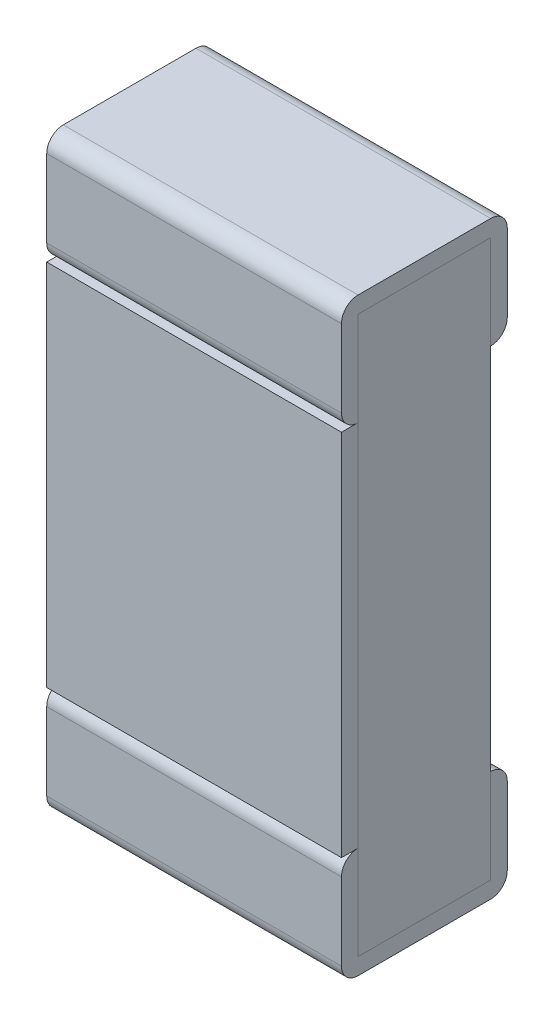
ISO-10303-21;
HEADER;
FILE_DESCRIPTION(('STEP AP214'),'2;1');
FILE_NAME('part.step','',(''),(''),'','','');
FILE_SCHEMA(('AUTOMOTIVE_DESIGN { 1 0 10303 214 1 1 1 1 }'));
ENDSEC;
DATA;
#1=APPLICATION_CONTEXT('core data for automotive mechanical design processes');
#2=APPLICATION_PROTOCOL_DEFINITION('international standard','automotive_design',2000,#1);
#3=PRODUCT_CONTEXT('',#1,'mechanical');
#4=PRODUCT('Part','Part','',(#3));
#5=PRODUCT_RELATED_PRODUCT_CATEGORY('part','',(#4));
#6=PRODUCT_DEFINITION_FORMATION('','',#4);
#7=PRODUCT_DEFINITION_CONTEXT('part definition',#1,'design');
#8=PRODUCT_DEFINITION('design','',#6,#7);
#9=PRODUCT_DEFINITION_SHAPE('','',#8);
#10=(LENGTH_UNIT() NAMED_UNIT(*) SI_UNIT(.MILLI.,.METRE.));
#11=(NAMED_UNIT(*) PLANE_ANGLE_UNIT() SI_UNIT($,.RADIAN.));
#12=(NAMED_UNIT(*) SI_UNIT($,.STERADIAN.) SOLID_ANGLE_UNIT());
#13=UNCERTAINTY_MEASURE_WITH_UNIT(LENGTH_MEASURE(1.E-05),#10,'distance_accuracy_value','');
#14=(GEOMETRIC_REPRESENTATION_CONTEXT(3) GLOBAL_UNCERTAINTY_ASSIGNED_CONTEXT((#13)) GLOBAL_UNIT_ASSIGNED_CONTEXT((#10,
#11,#12)) REPRESENTATION_CONTEXT('',''));
#15=CARTESIAN_POINT('',(0.,0.,0.));
#16=DIRECTION('',(0.,0.,1.));
#17=DIRECTION('',(1.,0.,0.));
#18=AXIS2_PLACEMENT_3D('',#15,#16,#17);
#19=CARTESIAN_POINT('',(123.284744279938,106.62604329235,142.661582908599));
#20=DIRECTION('',(0.,0.,1.));
#21=DIRECTION('',(1.,0.,0.));
#22=AXIS2_PLACEMENT_3D('',#19,#20,#21);
#23=PLANE('',#22);
#24=DIRECTION('',(1.,0.,0.));
#25=VECTOR('',#24,1.);
#26=CARTESIAN_POINT('',(123.284744279938,106.62604329235,142.661582908599));
#27=LINE('',#26,#25);
#28=CARTESIAN_POINT('',(123.284744279938,106.62604329235,142.661582908599));
#29=VERTEX_POINT('',#28);
#30=CARTESIAN_POINT('',(124.084744279938,106.62604329235,142.661582908599));
#31=VERTEX_POINT('',#30);
#32=EDGE_CURVE('E67',#29,#31,#27,.T.);
#33=ORIENTED_EDGE('',*,*,#32,.F.);
#34=DIRECTION('',(0.,-1.,0.));
#35=VECTOR('',#34,1.);
#36=CARTESIAN_POINT('',(123.284744279938,106.62604329235,142.661582908599));
#37=LINE('',#36,#35);
#38=CARTESIAN_POINT('',(123.284744279938,105.62604329235,142.661582908599));
#39=VERTEX_POINT('',#38);
#40=EDGE_CURVE('E11',#29,#39,#37,.T.);
#41=ORIENTED_EDGE('',*,*,#40,.T.);
#42=DIRECTION('',(1.,0.,0.));
#43=VECTOR('',#42,1.);
#44=CARTESIAN_POINT('',(123.284744279938,105.62604329235,142.661582908599));
#45=LINE('',#44,#43);
#46=CARTESIAN_POINT('',(124.084744279938,105.62604329235,142.661582908599));
#47=VERTEX_POINT('',#46);
#48=EDGE_CURVE('E55',#39,#47,#45,.T.);
#49=ORIENTED_EDGE('',*,*,#48,.T.);
#50=DIRECTION('',(0.,-1.,0.));
#51=VECTOR('',#50,1.);
#52=CARTESIAN_POINT('',(124.084744279938,106.62604329235,142.661582908599));
#53=LINE('',#52,#51);
#54=EDGE_CURVE('E165',#31,#47,#53,.T.);
#55=ORIENTED_EDGE('',*,*,#54,.F.);
#56=EDGE_LOOP('',(#33,#41,#49,#55));
#57=FACE_BOUND('',#56,.T.);
#58=ADVANCED_FACE('F44',(#57),#23,.T.);
#59=CARTESIAN_POINT('',(123.284744279938,105.62604329235,142.616582908599));
#60=DIRECTION('',(0.,-1.,0.));
#61=DIRECTION('',(0.,0.,-1.));
#62=AXIS2_PLACEMENT_3D('',#59,#60,#61);
#63=PLANE('',#62);
#64=DIRECTION('',(0.,0.,1.));
#65=VECTOR('',#64,1.);
#66=CARTESIAN_POINT('',(123.284744279938,105.62604329235,142.616582908599));
#67=LINE('',#66,#65);
#68=CARTESIAN_POINT('',(123.284744279938,105.62604329235,142.616582908599));
#69=VERTEX_POINT('',#68);
#70=EDGE_CURVE('E268',#69,#39,#67,.T.);
#71=ORIENTED_EDGE('',*,*,#70,.F.);
#72=DIRECTION('',(1.,0.,0.));
#73=VECTOR('',#72,1.);
#74=CARTESIAN_POINT('',(123.284744279938,105.62604329235,142.616582908599));
#75=LINE('',#74,#73);
#76=CARTESIAN_POINT('',(124.084744279938,105.62604329235,142.616582908599));
#77=VERTEX_POINT('',#76);
#78=EDGE_CURVE('E181',#69,#77,#75,.T.);
#79=ORIENTED_EDGE('',*,*,#78,.T.);
#80=DIRECTION('',(0.,0.,1.));
#81=VECTOR('',#80,1.);
#82=CARTESIAN_POINT('',(124.084744279938,105.62604329235,142.616582908599));
#83=LINE('',#82,#81);
#84=EDGE_CURVE('E170',#77,#47,#83,.T.);
#85=ORIENTED_EDGE('',*,*,#84,.T.);
#86=ORIENTED_EDGE('',*,*,#48,.F.);
#87=EDGE_LOOP('',(#71,#79,#85,#86));
#88=FACE_BOUND('',#87,.T.);
#89=ADVANCED_FACE('F183',(#88),#63,.T.);
#90=CARTESIAN_POINT('',(123.284744279938,105.58104329235,142.616582908599));
#91=DIRECTION('',(1.,0.,0.));
#92=DIRECTION('',(0.,1.,0.));
#93=AXIS2_PLACEMENT_3D('',#90,#91,#92);
#94=CYLINDRICAL_SURFACE('',#93,0.0450000000000034);
#95=CARTESIAN_POINT('',(123.284744279938,105.58104329235,142.616582908599));
#96=DIRECTION('',(1.,0.,0.));
#97=DIRECTION('',(0.,0.,1.));
#98=AXIS2_PLACEMENT_3D('',#95,#96,#97);
#99=CIRCLE('',#98,0.0449999999999895);
#100=CARTESIAN_POINT('',(123.284744279938,105.58104329235,142.661582908599));
#101=VERTEX_POINT('',#100);
#102=EDGE_CURVE('E187',#69,#101,#99,.T.);
#103=ORIENTED_EDGE('',*,*,#102,.T.);
#104=DIRECTION('',(1.,0.,0.));
#105=VECTOR('',#104,1.);
#106=CARTESIAN_POINT('',(123.284744279938,105.58104329235,142.661582908599));
#107=LINE('',#106,#105);
#108=CARTESIAN_POINT('',(124.084744279938,105.58104329235,142.661582908599));
#109=VERTEX_POINT('',#108);
#110=EDGE_CURVE('E196',#101,#109,#107,.T.);
#111=ORIENTED_EDGE('',*,*,#110,.T.);
#112=CARTESIAN_POINT('',(124.084744279938,105.58104329235,142.616582908599));
#113=DIRECTION('',(1.,0.,0.));
#114=DIRECTION('',(0.,0.,1.));
#115=AXIS2_PLACEMENT_3D('',#112,#113,#114);
#116=CIRCLE('',#115,0.0449999999999895);
#117=EDGE_CURVE('E229',#77,#109,#116,.T.);
#118=ORIENTED_EDGE('',*,*,#117,.F.);
#119=ORIENTED_EDGE('',*,*,#78,.F.);
#120=EDGE_LOOP('',(#103,#111,#118,#119));
#121=FACE_BOUND('',#120,.T.);
#122=ADVANCED_FACE('F477',(#121),#94,.T.);
#123=CARTESIAN_POINT('',(123.284744279938,105.62604329235,142.661582908599));
#124=DIRECTION('',(0.,0.,1.));
#125=DIRECTION('',(1.,0.,0.));
#126=AXIS2_PLACEMENT_3D('',#123,#124,#125);
#127=PLANE('',#126);
#128=DIRECTION('',(0.,-1.,0.));
#129=VECTOR('',#128,1.);
#130=CARTESIAN_POINT('',(124.084744279938,105.62604329235,142.661582908599));
#131=LINE('',#130,#129);
#132=CARTESIAN_POINT('',(124.084744279938,105.37104329235,142.661582908599));
#133=VERTEX_POINT('',#132);
#134=EDGE_CURVE('E223',#109,#133,#131,.T.);
#135=ORIENTED_EDGE('',*,*,#134,.F.);
#136=ORIENTED_EDGE('',*,*,#110,.F.);
#137=DIRECTION('',(0.,-1.,0.));
#138=VECTOR('',#137,1.);
#139=CARTESIAN_POINT('',(123.284744279938,105.62604329235,142.661582908599));
#140=LINE('',#139,#138);
#141=CARTESIAN_POINT('',(123.284744279938,105.37104329235,142.661582908599));
#142=VERTEX_POINT('',#141);
#143=EDGE_CURVE('E238',#101,#142,#140,.T.);
#144=ORIENTED_EDGE('',*,*,#143,.T.);
#145=DIRECTION('',(1.,0.,0.));
#146=VECTOR('',#145,1.);
#147=CARTESIAN_POINT('',(123.284744279938,105.37104329235,142.661582908599));
#148=LINE('',#147,#146);
#149=EDGE_CURVE('E234',#142,#133,#148,.T.);
#150=ORIENTED_EDGE('',*,*,#149,.T.);
#151=EDGE_LOOP('',(#135,#136,#144,#150));
#152=FACE_BOUND('',#151,.T.);
#153=ADVANCED_FACE('F568',(#152),#127,.T.);
#154=CARTESIAN_POINT('',(123.284744279938,105.37104329235,142.616582908599));
#155=DIRECTION('',(1.,0.,0.));
#156=DIRECTION('',(0.,-1.,0.));
#157=AXIS2_PLACEMENT_3D('',#154,#155,#156);
#158=CYLINDRICAL_SURFACE('',#157,0.0450000000000034);
#159=DIRECTION('',(1.,0.,0.));
#160=VECTOR('',#159,1.);
#161=CARTESIAN_POINT('',(123.284744279938,105.32604329235,142.616582908599));
#162=LINE('',#161,#160);
#163=CARTESIAN_POINT('',(123.284744279938,105.32604329235,142.616582908599));
#164=VERTEX_POINT('',#163);
#165=CARTESIAN_POINT('',(124.084744279938,105.32604329235,142.616582908599));
#166=VERTEX_POINT('',#165);
#167=EDGE_CURVE('E239',#164,#166,#162,.T.);
#168=ORIENTED_EDGE('',*,*,#167,.T.);
#169=CARTESIAN_POINT('',(124.084744279938,105.37104329235,142.616582908599));
#170=DIRECTION('',(-1.,0.,0.));
#171=DIRECTION('',(0.,0.,1.));
#172=AXIS2_PLACEMENT_3D('',#169,#170,#171);
#173=CIRCLE('',#172,0.0449999999999895);
#174=EDGE_CURVE('E243',#166,#133,#173,.T.);
#175=ORIENTED_EDGE('',*,*,#174,.T.);
#176=ORIENTED_EDGE('',*,*,#149,.F.);
#177=CARTESIAN_POINT('',(123.284744279938,105.37104329235,142.616582908599));
#178=DIRECTION('',(-1.,0.,0.));
#179=DIRECTION('',(0.,0.,1.));
#180=AXIS2_PLACEMENT_3D('',#177,#178,#179);
#181=CIRCLE('',#180,0.0449999999999895);
#182=EDGE_CURVE('E206',#164,#142,#181,.T.);
#183=ORIENTED_EDGE('',*,*,#182,.F.);
#184=EDGE_LOOP('',(#168,#175,#176,#183));
#185=FACE_BOUND('',#184,.T.);
#186=ADVANCED_FACE('F389',(#185),#158,.T.);
#187=CARTESIAN_POINT('',(123.284744279938,105.32604329235,142.211582908599));
#188=DIRECTION('',(0.,-1.,0.));
#189=DIRECTION('',(0.,0.,-1.));
#190=AXIS2_PLACEMENT_3D('',#187,#188,#189);
#191=PLANE('',#190);
#192=DIRECTION('',(0.,0.,1.));
#193=VECTOR('',#192,1.);
#194=CARTESIAN_POINT('',(123.284744279938,105.32604329235,142.211582908599));
#195=LINE('',#194,#193);
#196=CARTESIAN_POINT('',(123.284744279938,105.32604329235,142.256582908599));
#197=VERTEX_POINT('',#196);
#198=EDGE_CURVE('E202',#197,#164,#195,.T.);
#199=ORIENTED_EDGE('',*,*,#198,.F.);
#200=DIRECTION('',(1.,0.,0.));
#201=VECTOR('',#200,1.);
#202=CARTESIAN_POINT('',(123.284744279938,105.32604329235,142.256582908599));
#203=LINE('',#202,#201);
#204=CARTESIAN_POINT('',(124.084744279938,105.32604329235,142.256582908599));
#205=VERTEX_POINT('',#204);
#206=EDGE_CURVE('E217',#197,#205,#203,.T.);
#207=ORIENTED_EDGE('',*,*,#206,.T.);
#208=DIRECTION('',(0.,0.,1.));
#209=VECTOR('',#208,1.);
#210=CARTESIAN_POINT('',(124.084744279938,105.32604329235,142.211582908599));
#211=LINE('',#210,#209);
#212=EDGE_CURVE('E213',#205,#166,#211,.T.);
#213=ORIENTED_EDGE('',*,*,#212,.T.);
#214=ORIENTED_EDGE('',*,*,#167,.F.);
#215=EDGE_LOOP('',(#199,#207,#213,#214));
#216=FACE_BOUND('',#215,.T.);
#217=ADVANCED_FACE('F397',(#216),#191,.T.);
#218=CARTESIAN_POINT('',(123.284744279938,105.37104329235,142.256582908599));
#219=DIRECTION('',(1.,0.,0.));
#220=DIRECTION('',(0.,-1.,0.));
#221=AXIS2_PLACEMENT_3D('',#218,#219,#220);
#222=CYLINDRICAL_SURFACE('',#221,0.0450000000000034);
#223=CARTESIAN_POINT('',(123.284744279938,105.37104329235,142.256582908599));
#224=DIRECTION('',(1.,0.,0.));
#225=DIRECTION('',(0.,0.,1.));
#226=AXIS2_PLACEMENT_3D('',#223,#224,#225);
#227=CIRCLE('',#226,0.0449999999999895);
#228=CARTESIAN_POINT('',(123.284744279938,105.37104329235,142.211582908599));
#229=VERTEX_POINT('',#228);
#230=EDGE_CURVE('E218',#197,#229,#227,.T.);
#231=ORIENTED_EDGE('',*,*,#230,.T.);
#232=DIRECTION('',(1.,0.,0.));
#233=VECTOR('',#232,1.);
#234=CARTESIAN_POINT('',(123.284744279938,105.37104329235,142.211582908599));
#235=LINE('',#234,#233);
#236=CARTESIAN_POINT('',(124.084744279938,105.37104329235,142.211582908599));
#237=VERTEX_POINT('',#236);
#238=EDGE_CURVE('E329',#229,#237,#235,.T.);
#239=ORIENTED_EDGE('',*,*,#238,.T.);
#240=CARTESIAN_POINT('',(124.084744279938,105.37104329235,142.256582908599));
#241=DIRECTION('',(1.,0.,0.));
#242=DIRECTION('',(0.,0.,1.));
#243=AXIS2_PLACEMENT_3D('',#240,#241,#242);
#244=CIRCLE('',#243,0.0449999999999895);
#245=EDGE_CURVE('E219',#205,#237,#244,.T.);
#246=ORIENTED_EDGE('',*,*,#245,.F.);
#247=ORIENTED_EDGE('',*,*,#206,.F.);
#248=EDGE_LOOP('',(#231,#239,#246,#247));
#249=FACE_BOUND('',#248,.T.);
#250=ADVANCED_FACE('F547',(#249),#222,.T.);
#251=CARTESIAN_POINT('',(123.284744279938,105.62604329235,142.211582908599));
#252=DIRECTION('',(0.,0.,1.));
#253=DIRECTION('',(1.,0.,0.));
#254=AXIS2_PLACEMENT_3D('',#251,#252,#253);
#255=PLANE('',#254);
#256=ORIENTED_EDGE('',*,*,#238,.F.);
#257=DIRECTION('',(0.,-1.,0.));
#258=VECTOR('',#257,1.);
#259=CARTESIAN_POINT('',(123.284744279938,105.62604329235,142.211582908599));
#260=LINE('',#259,#258);
#261=CARTESIAN_POINT('',(123.284744279938,105.58104329235,142.211582908599));
#262=VERTEX_POINT('',#261);
#263=EDGE_CURVE('E259',#262,#229,#260,.T.);
#264=ORIENTED_EDGE('',*,*,#263,.F.);
#265=DIRECTION('',(1.,0.,0.));
#266=VECTOR('',#265,1.);
#267=CARTESIAN_POINT('',(123.284744279938,105.58104329235,142.211582908599));
#268=LINE('',#267,#266);
#269=CARTESIAN_POINT('',(124.084744279938,105.58104329235,142.211582908599));
#270=VERTEX_POINT('',#269);
#271=EDGE_CURVE('E489',#262,#270,#268,.T.);
#272=ORIENTED_EDGE('',*,*,#271,.T.);
#273=DIRECTION('',(0.,-1.,0.));
#274=VECTOR('',#273,1.);
#275=CARTESIAN_POINT('',(124.084744279938,105.62604329235,142.211582908599));
#276=LINE('',#275,#274);
#277=EDGE_CURVE('E496',#270,#237,#276,.T.);
#278=ORIENTED_EDGE('',*,*,#277,.T.);
#279=EDGE_LOOP('',(#256,#264,#272,#278));
#280=FACE_BOUND('',#279,.T.);
#281=ADVANCED_FACE('F545',(#280),#255,.F.);
#282=CARTESIAN_POINT('',(123.284744279938,105.58104329235,142.256582908599));
#283=DIRECTION('',(1.,0.,0.));
#284=DIRECTION('',(0.,1.,0.));
#285=AXIS2_PLACEMENT_3D('',#282,#283,#284);
#286=CYLINDRICAL_SURFACE('',#285,0.0450000000000034);
#287=DIRECTION('',(1.,0.,0.));
#288=VECTOR('',#287,1.);
#289=CARTESIAN_POINT('',(123.284744279938,105.62604329235,142.256582908599));
#290=LINE('',#289,#288);
#291=CARTESIAN_POINT('',(123.284744279938,105.62604329235,142.256582908599));
#292=VERTEX_POINT('',#291);
#293=CARTESIAN_POINT('',(124.084744279938,105.62604329235,142.256582908599));
#294=VERTEX_POINT('',#293);
#295=EDGE_CURVE('E486',#292,#294,#290,.T.);
#296=ORIENTED_EDGE('',*,*,#295,.T.);
#297=CARTESIAN_POINT('',(124.084744279938,105.58104329235,142.256582908599));
#298=DIRECTION('',(-1.,0.,0.));
#299=DIRECTION('',(0.,0.,1.));
#300=AXIS2_PLACEMENT_3D('',#297,#298,#299);
#301=CIRCLE('',#300,0.0449999999999895);
#302=EDGE_CURVE('E301',#294,#270,#301,.T.);
#303=ORIENTED_EDGE('',*,*,#302,.T.);
#304=ORIENTED_EDGE('',*,*,#271,.F.);
#305=CARTESIAN_POINT('',(123.284744279938,105.58104329235,142.256582908599));
#306=DIRECTION('',(-1.,0.,0.));
#307=DIRECTION('',(0.,0.,1.));
#308=AXIS2_PLACEMENT_3D('',#305,#306,#307);
#309=CIRCLE('',#308,0.0449999999999895);
#310=EDGE_CURVE('E263',#292,#262,#309,.T.);
#311=ORIENTED_EDGE('',*,*,#310,.F.);
#312=EDGE_LOOP('',(#296,#303,#304,#311));
#313=FACE_BOUND('',#312,.T.);
#314=ADVANCED_FACE('F484',(#313),#286,.T.);
#315=CARTESIAN_POINT('',(124.084744279938,106.62604329235,142.616582908599));
#316=DIRECTION('',(1.,0.,0.));
#317=DIRECTION('',(0.,1.,0.));
#318=AXIS2_PLACEMENT_3D('',#315,#316,#317);
#319=PLANE('',#318);
#320=DIRECTION('',(0.,-1.,0.));
#321=VECTOR('',#320,1.);
#322=CARTESIAN_POINT('',(124.084744279938,106.62604329235,142.616582908599));
#323=LINE('',#322,#321);
#324=CARTESIAN_POINT('',(124.084744279938,106.62604329235,142.616582908599));
#325=VERTEX_POINT('',#324);
#326=EDGE_CURVE('E224',#325,#77,#323,.T.);
#327=ORIENTED_EDGE('',*,*,#326,.F.);
#328=DIRECTION('',(0.,0.,1.));
#329=VECTOR('',#328,1.);
#330=CARTESIAN_POINT('',(124.084744279938,106.62604329235,142.616582908599));
#331=LINE('',#330,#329);
#332=EDGE_CURVE('E173',#325,#31,#331,.T.);
#333=ORIENTED_EDGE('',*,*,#332,.T.);
#334=ORIENTED_EDGE('',*,*,#54,.T.);
#335=ORIENTED_EDGE('',*,*,#84,.F.);
#336=EDGE_LOOP('',(#327,#333,#334,#335));
#337=FACE_BOUND('',#336,.T.);
#338=ADVANCED_FACE('F168',(#337),#319,.T.);
#339=CARTESIAN_POINT('',(124.084744279938,105.62604329235,142.211582908599));
#340=DIRECTION('',(1.,0.,0.));
#341=DIRECTION('',(0.,1.,0.));
#342=AXIS2_PLACEMENT_3D('',#339,#340,#341);
#343=PLANE('',#342);
#344=ORIENTED_EDGE('',*,*,#277,.F.);
#345=ORIENTED_EDGE('',*,*,#302,.F.);
#346=DIRECTION('',(0.,-1.,0.));
#347=VECTOR('',#346,1.);
#348=CARTESIAN_POINT('',(124.084744279938,106.88104329235,142.256582908599));
#349=LINE('',#348,#347);
#350=CARTESIAN_POINT('',(124.084744279938,105.37104329235,142.256582908599));
#351=VERTEX_POINT('',#350);
#352=EDGE_CURVE('E175',#294,#351,#349,.T.);
#353=ORIENTED_EDGE('',*,*,#352,.T.);
#354=DIRECTION('',(0.,0.,1.));
#355=VECTOR('',#354,1.);
#356=CARTESIAN_POINT('',(124.084744279938,105.37104329235,142.256582908599));
#357=LINE('',#356,#355);
#358=CARTESIAN_POINT('',(124.084744279938,105.37104329235,142.616582908599));
#359=VERTEX_POINT('',#358);
#360=EDGE_CURVE('E233',#351,#359,#357,.T.);
#361=ORIENTED_EDGE('',*,*,#360,.T.);
#362=DIRECTION('',(0.,-1.,0.));
#363=VECTOR('',#362,1.);
#364=CARTESIAN_POINT('',(124.084744279938,106.88104329235,142.616582908599));
#365=LINE('',#364,#363);
#366=EDGE_CURVE('E210',#77,#359,#365,.T.);
#367=ORIENTED_EDGE('',*,*,#366,.F.);
#368=ORIENTED_EDGE('',*,*,#117,.T.);
#369=ORIENTED_EDGE('',*,*,#134,.T.);
#370=ORIENTED_EDGE('',*,*,#174,.F.);
#371=ORIENTED_EDGE('',*,*,#212,.F.);
#372=ORIENTED_EDGE('',*,*,#245,.T.);
#373=EDGE_LOOP('',(#344,#345,#353,#361,#367,#368,#369,#370,#371,#372));
#374=FACE_BOUND('',#373,.T.);
#375=ADVANCED_FACE('F401',(#374),#343,.T.);
#376=CARTESIAN_POINT('',(123.284744279938,106.62604329235,142.616582908599));
#377=DIRECTION('',(0.,-1.,0.));
#378=DIRECTION('',(0.,0.,-1.));
#379=AXIS2_PLACEMENT_3D('',#376,#377,#378);
#380=PLANE('',#379);
#381=ORIENTED_EDGE('',*,*,#32,.T.);
#382=ORIENTED_EDGE('',*,*,#332,.F.);
#383=DIRECTION('',(1.,0.,0.));
#384=VECTOR('',#383,1.);
#385=CARTESIAN_POINT('',(123.284744279938,106.62604329235,142.616582908599));
#386=LINE('',#385,#384);
#387=CARTESIAN_POINT('',(123.284744279938,106.62604329235,142.616582908599));
#388=VERTEX_POINT('',#387);
#389=EDGE_CURVE('E207',#388,#325,#386,.T.);
#390=ORIENTED_EDGE('',*,*,#389,.F.);
#391=DIRECTION('',(0.,0.,1.));
#392=VECTOR('',#391,1.);
#393=CARTESIAN_POINT('',(123.284744279938,106.62604329235,142.616582908599));
#394=LINE('',#393,#392);
#395=EDGE_CURVE('E342',#388,#29,#394,.T.);
#396=ORIENTED_EDGE('',*,*,#395,.T.);
#397=EDGE_LOOP('',(#381,#382,#390,#396));
#398=FACE_BOUND('',#397,.T.);
#399=ADVANCED_FACE('F576',(#398),#380,.F.);
#400=CARTESIAN_POINT('',(123.284744279938,106.62604329235,142.616582908599));
#401=DIRECTION('',(1.,0.,0.));
#402=DIRECTION('',(0.,1.,0.));
#403=AXIS2_PLACEMENT_3D('',#400,#401,#402);
#404=PLANE('',#403);
#405=ORIENTED_EDGE('',*,*,#70,.T.);
#406=ORIENTED_EDGE('',*,*,#40,.F.);
#407=ORIENTED_EDGE('',*,*,#395,.F.);
#408=DIRECTION('',(0.,-1.,0.));
#409=VECTOR('',#408,1.);
#410=CARTESIAN_POINT('',(123.284744279938,106.62604329235,142.616582908599));
#411=LINE('',#410,#409);
#412=EDGE_CURVE('E205',#388,#69,#411,.T.);
#413=ORIENTED_EDGE('',*,*,#412,.T.);
#414=EDGE_LOOP('',(#405,#406,#407,#413));
#415=FACE_BOUND('',#414,.T.);
#416=ADVANCED_FACE('F469',(#415),#404,.F.);
#417=CARTESIAN_POINT('',(123.284744279938,105.62604329235,142.211582908599));
#418=DIRECTION('',(1.,0.,0.));
#419=DIRECTION('',(0.,1.,0.));
#420=AXIS2_PLACEMENT_3D('',#417,#418,#419);
#421=PLANE('',#420);
#422=ORIENTED_EDGE('',*,*,#230,.F.);
#423=ORIENTED_EDGE('',*,*,#198,.T.);
#424=ORIENTED_EDGE('',*,*,#182,.T.);
#425=ORIENTED_EDGE('',*,*,#143,.F.);
#426=ORIENTED_EDGE('',*,*,#102,.F.);
#427=DIRECTION('',(0.,-1.,0.));
#428=VECTOR('',#427,1.);
#429=CARTESIAN_POINT('',(123.284744279938,106.88104329235,142.616582908599));
#430=LINE('',#429,#428);
#431=CARTESIAN_POINT('',(123.284744279938,105.37104329235,142.616582908599));
#432=VERTEX_POINT('',#431);
#433=EDGE_CURVE('E279',#69,#432,#430,.T.);
#434=ORIENTED_EDGE('',*,*,#433,.T.);
#435=DIRECTION('',(0.,0.,1.));
#436=VECTOR('',#435,1.);
#437=CARTESIAN_POINT('',(123.284744279938,105.37104329235,142.256582908599));
#438=LINE('',#437,#436);
#439=CARTESIAN_POINT('',(123.284744279938,105.37104329235,142.256582908599));
#440=VERTEX_POINT('',#439);
#441=EDGE_CURVE('E258',#440,#432,#438,.T.);
#442=ORIENTED_EDGE('',*,*,#441,.F.);
#443=DIRECTION('',(0.,-1.,0.));
#444=VECTOR('',#443,1.);
#445=CARTESIAN_POINT('',(123.284744279938,106.88104329235,142.256582908599));
#446=LINE('',#445,#444);
#447=EDGE_CURVE('E254',#292,#440,#446,.T.);
#448=ORIENTED_EDGE('',*,*,#447,.F.);
#449=ORIENTED_EDGE('',*,*,#310,.T.);
#450=ORIENTED_EDGE('',*,*,#263,.T.);
#451=EDGE_LOOP('',(#422,#423,#424,#425,#426,#434,#442,#448,#449,#450));
#452=FACE_BOUND('',#451,.T.);
#453=ADVANCED_FACE('F473',(#452),#421,.F.);
#454=CARTESIAN_POINT('',(123.284744279938,106.88104329235,142.256582908599));
#455=DIRECTION('',(0.,0.,1.));
#456=DIRECTION('',(1.,0.,0.));
#457=AXIS2_PLACEMENT_3D('',#454,#455,#456);
#458=PLANE('',#457);
#459=DIRECTION('',(0.,-1.,0.));
#460=VECTOR('',#459,1.);
#461=CARTESIAN_POINT('',(124.084744279938,106.88104329235,142.256582908599));
#462=LINE('',#461,#460);
#463=CARTESIAN_POINT('',(124.084744279938,106.62604329235,142.256582908599));
#464=VERTEX_POINT('',#463);
#465=EDGE_CURVE('E264',#464,#294,#462,.T.);
#466=ORIENTED_EDGE('',*,*,#465,.T.);
#467=ORIENTED_EDGE('',*,*,#295,.F.);
#468=DIRECTION('',(0.,-1.,0.));
#469=VECTOR('',#468,1.);
#470=CARTESIAN_POINT('',(123.284744279938,106.88104329235,142.256582908599));
#471=LINE('',#470,#469);
#472=CARTESIAN_POINT('',(123.284744279938,106.62604329235,142.256582908599));
#473=VERTEX_POINT('',#472);
#474=EDGE_CURVE('E253',#473,#292,#471,.T.);
#475=ORIENTED_EDGE('',*,*,#474,.F.);
#476=DIRECTION('',(1.,0.,0.));
#477=VECTOR('',#476,1.);
#478=CARTESIAN_POINT('',(123.284744279938,106.62604329235,142.256582908599));
#479=LINE('',#478,#477);
#480=EDGE_CURVE('E346',#473,#464,#479,.T.);
#481=ORIENTED_EDGE('',*,*,#480,.T.);
#482=EDGE_LOOP('',(#466,#467,#475,#481));
#483=FACE_BOUND('',#482,.T.);
#484=ADVANCED_FACE('F492',(#483),#458,.F.);
#485=CARTESIAN_POINT('',(124.084744279938,106.88104329235,142.256582908599));
#486=DIRECTION('',(1.,0.,0.));
#487=DIRECTION('',(0.,1.,0.));
#488=AXIS2_PLACEMENT_3D('',#485,#486,#487);
#489=PLANE('',#488);
#490=DIRECTION('',(0.,-1.,0.));
#491=VECTOR('',#490,1.);
#492=CARTESIAN_POINT('',(124.084744279938,106.88104329235,142.256582908599));
#493=LINE('',#492,#491);
#494=CARTESIAN_POINT('',(124.084744279938,106.88104329235,142.256582908599));
#495=VERTEX_POINT('',#494);
#496=EDGE_CURVE('E306',#495,#464,#493,.T.);
#497=ORIENTED_EDGE('',*,*,#496,.F.);
#498=DIRECTION('',(0.,0.,1.));
#499=VECTOR('',#498,1.);
#500=CARTESIAN_POINT('',(124.084744279938,106.88104329235,142.256582908599));
#501=LINE('',#500,#499);
#502=CARTESIAN_POINT('',(124.084744279938,106.88104329235,142.616582908599));
#503=VERTEX_POINT('',#502);
#504=EDGE_CURVE('E314',#495,#503,#501,.T.);
#505=ORIENTED_EDGE('',*,*,#504,.T.);
#506=DIRECTION('',(0.,-1.,0.));
#507=VECTOR('',#506,1.);
#508=CARTESIAN_POINT('',(124.084744279938,106.88104329235,142.616582908599));
#509=LINE('',#508,#507);
#510=EDGE_CURVE('E228',#503,#325,#509,.T.);
#511=ORIENTED_EDGE('',*,*,#510,.T.);
#512=ORIENTED_EDGE('',*,*,#326,.T.);
#513=ORIENTED_EDGE('',*,*,#366,.T.);
#514=ORIENTED_EDGE('',*,*,#360,.F.);
#515=ORIENTED_EDGE('',*,*,#352,.F.);
#516=ORIENTED_EDGE('',*,*,#465,.F.);
#517=EDGE_LOOP('',(#497,#505,#511,#512,#513,#514,#515,#516));
#518=FACE_BOUND('',#517,.T.);
#519=ADVANCED_FACE('F620',(#518),#489,.T.);
#520=CARTESIAN_POINT('',(123.284744279938,106.67104329235,142.616582908599));
#521=DIRECTION('',(1.,0.,0.));
#522=DIRECTION('',(0.,-1.,0.));
#523=AXIS2_PLACEMENT_3D('',#520,#521,#522);
#524=CYLINDRICAL_SURFACE('',#523,0.0450000000000034);
#525=ORIENTED_EDGE('',*,*,#389,.T.);
#526=CARTESIAN_POINT('',(124.084744279938,106.67104329235,142.616582908599));
#527=DIRECTION('',(-1.,0.,0.));
#528=DIRECTION('',(0.,0.,1.));
#529=AXIS2_PLACEMENT_3D('',#526,#527,#528);
#530=CIRCLE('',#529,0.0449999999999895);
#531=CARTESIAN_POINT('',(124.084744279938,106.67104329235,142.661582908599));
#532=VERTEX_POINT('',#531);
#533=EDGE_CURVE('E211',#325,#532,#530,.T.);
#534=ORIENTED_EDGE('',*,*,#533,.T.);
#535=DIRECTION('',(1.,0.,0.));
#536=VECTOR('',#535,1.);
#537=CARTESIAN_POINT('',(123.284744279938,106.67104329235,142.661582908599));
#538=LINE('',#537,#536);
#539=CARTESIAN_POINT('',(123.284744279938,106.67104329235,142.661582908599));
#540=VERTEX_POINT('',#539);
#541=EDGE_CURVE('E248',#540,#532,#538,.T.);
#542=ORIENTED_EDGE('',*,*,#541,.F.);
#543=CARTESIAN_POINT('',(123.284744279938,106.67104329235,142.616582908599));
#544=DIRECTION('',(-1.,0.,0.));
#545=DIRECTION('',(0.,0.,1.));
#546=AXIS2_PLACEMENT_3D('',#543,#544,#545);
#547=CIRCLE('',#546,0.0449999999999895);
#548=EDGE_CURVE('E339',#388,#540,#547,.T.);
#549=ORIENTED_EDGE('',*,*,#548,.F.);
#550=EDGE_LOOP('',(#525,#534,#542,#549));
#551=FACE_BOUND('',#550,.T.);
#552=ADVANCED_FACE('F624',(#551),#524,.T.);
#553=CARTESIAN_POINT('',(123.284744279938,106.92604329235,142.661582908599));
#554=DIRECTION('',(0.,0.,1.));
#555=DIRECTION('',(1.,0.,0.));
#556=AXIS2_PLACEMENT_3D('',#553,#554,#555);
#557=PLANE('',#556);
#558=DIRECTION('',(0.,-1.,0.));
#559=VECTOR('',#558,1.);
#560=CARTESIAN_POINT('',(124.084744279938,106.92604329235,142.661582908599));
#561=LINE('',#560,#559);
#562=CARTESIAN_POINT('',(124.084744279938,106.88104329235,142.661582908599));
#563=VERTEX_POINT('',#562);
#564=EDGE_CURVE('E350',#563,#532,#561,.T.);
#565=ORIENTED_EDGE('',*,*,#564,.F.);
#566=DIRECTION('',(1.,0.,0.));
#567=VECTOR('',#566,1.);
#568=CARTESIAN_POINT('',(123.284744279938,106.88104329235,142.661582908599));
#569=LINE('',#568,#567);
#570=CARTESIAN_POINT('',(123.284744279938,106.88104329235,142.661582908599));
#571=VERTEX_POINT('',#570);
#572=EDGE_CURVE('E360',#571,#563,#569,.T.);
#573=ORIENTED_EDGE('',*,*,#572,.F.);
#574=DIRECTION('',(0.,-1.,0.));
#575=VECTOR('',#574,1.);
#576=CARTESIAN_POINT('',(123.284744279938,106.92604329235,142.661582908599));
#577=LINE('',#576,#575);
#578=EDGE_CURVE('E252',#571,#540,#577,.T.);
#579=ORIENTED_EDGE('',*,*,#578,.T.);
#580=ORIENTED_EDGE('',*,*,#541,.T.);
#581=EDGE_LOOP('',(#565,#573,#579,#580));
#582=FACE_BOUND('',#581,.T.);
#583=ADVANCED_FACE('F579',(#582),#557,.T.);
#584=CARTESIAN_POINT('',(123.284744279938,106.88104329235,142.256582908599));
#585=DIRECTION('',(1.,0.,0.));
#586=DIRECTION('',(0.,1.,0.));
#587=AXIS2_PLACEMENT_3D('',#584,#585,#586);
#588=PLANE('',#587);
#589=ORIENTED_EDGE('',*,*,#474,.T.);
#590=ORIENTED_EDGE('',*,*,#447,.T.);
#591=ORIENTED_EDGE('',*,*,#441,.T.);
#592=ORIENTED_EDGE('',*,*,#433,.F.);
#593=ORIENTED_EDGE('',*,*,#412,.F.);
#594=DIRECTION('',(0.,-1.,0.));
#595=VECTOR('',#594,1.);
#596=CARTESIAN_POINT('',(123.284744279938,106.88104329235,142.616582908599));
#597=LINE('',#596,#595);
#598=CARTESIAN_POINT('',(123.284744279938,106.88104329235,142.616582908599));
#599=VERTEX_POINT('',#598);
#600=EDGE_CURVE('E334',#599,#388,#597,.T.);
#601=ORIENTED_EDGE('',*,*,#600,.F.);
#602=DIRECTION('',(0.,0.,1.));
#603=VECTOR('',#602,1.);
#604=CARTESIAN_POINT('',(123.284744279938,106.88104329235,142.256582908599));
#605=LINE('',#604,#603);
#606=CARTESIAN_POINT('',(123.284744279938,106.88104329235,142.256582908599));
#607=VERTEX_POINT('',#606);
#608=EDGE_CURVE('E338',#607,#599,#605,.T.);
#609=ORIENTED_EDGE('',*,*,#608,.F.);
#610=DIRECTION('',(0.,-1.,0.));
#611=VECTOR('',#610,1.);
#612=CARTESIAN_POINT('',(123.284744279938,106.88104329235,142.256582908599));
#613=LINE('',#612,#611);
#614=EDGE_CURVE('E356',#607,#473,#613,.T.);
#615=ORIENTED_EDGE('',*,*,#614,.T.);
#616=EDGE_LOOP('',(#589,#590,#591,#592,#593,#601,#609,#615));
#617=FACE_BOUND('',#616,.T.);
#618=ADVANCED_FACE('F478',(#617),#588,.F.);
#619=CARTESIAN_POINT('',(123.284744279938,106.67104329235,142.256582908599));
#620=DIRECTION('',(1.,0.,0.));
#621=DIRECTION('',(0.,-1.,0.));
#622=AXIS2_PLACEMENT_3D('',#619,#620,#621);
#623=CYLINDRICAL_SURFACE('',#622,0.0450000000000034);
#624=CARTESIAN_POINT('',(123.284744279938,106.67104329235,142.256582908599));
#625=DIRECTION('',(1.,0.,0.));
#626=DIRECTION('',(0.,0.,1.));
#627=AXIS2_PLACEMENT_3D('',#624,#625,#626);
#628=CIRCLE('',#627,0.0449999999999895);
#629=CARTESIAN_POINT('',(123.284744279938,106.67104329235,142.211582908599));
#630=VERTEX_POINT('',#629);
#631=EDGE_CURVE('E372',#473,#630,#628,.T.);
#632=ORIENTED_EDGE('',*,*,#631,.T.);
#633=DIRECTION('',(1.,0.,0.));
#634=VECTOR('',#633,1.);
#635=CARTESIAN_POINT('',(123.284744279938,106.67104329235,142.211582908599));
#636=LINE('',#635,#634);
#637=CARTESIAN_POINT('',(124.084744279938,106.67104329235,142.211582908599));
#638=VERTEX_POINT('',#637);
#639=EDGE_CURVE('E363',#630,#638,#636,.T.);
#640=ORIENTED_EDGE('',*,*,#639,.T.);
#641=CARTESIAN_POINT('',(124.084744279938,106.67104329235,142.256582908599));
#642=DIRECTION('',(1.,0.,0.));
#643=DIRECTION('',(0.,0.,1.));
#644=AXIS2_PLACEMENT_3D('',#641,#642,#643);
#645=CIRCLE('',#644,0.0449999999999895);
#646=EDGE_CURVE('E303',#464,#638,#645,.T.);
#647=ORIENTED_EDGE('',*,*,#646,.F.);
#648=ORIENTED_EDGE('',*,*,#480,.F.);
#649=EDGE_LOOP('',(#632,#640,#647,#648));
#650=FACE_BOUND('',#649,.T.);
#651=ADVANCED_FACE('F578',(#650),#623,.T.);
#652=CARTESIAN_POINT('',(123.284744279938,106.92604329235,142.211582908599));
#653=DIRECTION('',(0.,0.,1.));
#654=DIRECTION('',(1.,0.,0.));
#655=AXIS2_PLACEMENT_3D('',#652,#653,#654);
#656=PLANE('',#655);
#657=ORIENTED_EDGE('',*,*,#639,.F.);
#658=DIRECTION('',(0.,-1.,0.));
#659=VECTOR('',#658,1.);
#660=CARTESIAN_POINT('',(123.284744279938,106.92604329235,142.211582908599));
#661=LINE('',#660,#659);
#662=CARTESIAN_POINT('',(123.284744279938,106.88104329235,142.211582908599));
#663=VERTEX_POINT('',#662);
#664=EDGE_CURVE('E48',#663,#630,#661,.T.);
#665=ORIENTED_EDGE('',*,*,#664,.F.);
#666=DIRECTION('',(1.,0.,0.));
#667=VECTOR('',#666,1.);
#668=CARTESIAN_POINT('',(123.284744279938,106.88104329235,142.211582908599));
#669=LINE('',#668,#667);
#670=CARTESIAN_POINT('',(124.084744279938,106.88104329235,142.211582908599));
#671=VERTEX_POINT('',#670);
#672=EDGE_CURVE('E333',#663,#671,#669,.T.);
#673=ORIENTED_EDGE('',*,*,#672,.T.);
#674=DIRECTION('',(0.,-1.,0.));
#675=VECTOR('',#674,1.);
#676=CARTESIAN_POINT('',(124.084744279938,106.92604329235,142.211582908599));
#677=LINE('',#676,#675);
#678=EDGE_CURVE('E275',#671,#638,#677,.T.);
#679=ORIENTED_EDGE('',*,*,#678,.T.);
#680=EDGE_LOOP('',(#657,#665,#673,#679));
#681=FACE_BOUND('',#680,.T.);
#682=ADVANCED_FACE('F583',(#681),#656,.F.);
#683=CARTESIAN_POINT('',(124.084744279938,106.92604329235,142.211582908599));
#684=DIRECTION('',(1.,0.,0.));
#685=DIRECTION('',(0.,1.,0.));
#686=AXIS2_PLACEMENT_3D('',#683,#684,#685);
#687=PLANE('',#686);
#688=ORIENTED_EDGE('',*,*,#678,.F.);
#689=CARTESIAN_POINT('',(124.084744279938,106.88104329235,142.256582908599));
#690=DIRECTION('',(-1.,0.,0.));
#691=DIRECTION('',(0.,0.,1.));
#692=AXIS2_PLACEMENT_3D('',#689,#690,#691);
#693=CIRCLE('',#692,0.0449999999999895);
#694=CARTESIAN_POINT('',(124.084744279938,106.92604329235,142.256582908599));
#695=VERTEX_POINT('',#694);
#696=EDGE_CURVE('E519',#695,#671,#693,.T.);
#697=ORIENTED_EDGE('',*,*,#696,.F.);
#698=DIRECTION('',(0.,0.,1.));
#699=VECTOR('',#698,1.);
#700=CARTESIAN_POINT('',(124.084744279938,106.92604329235,142.211582908599));
#701=LINE('',#700,#699);
#702=CARTESIAN_POINT('',(124.084744279938,106.92604329235,142.616582908599));
#703=VERTEX_POINT('',#702);
#704=EDGE_CURVE('E272',#695,#703,#701,.T.);
#705=ORIENTED_EDGE('',*,*,#704,.T.);
#706=CARTESIAN_POINT('',(124.084744279938,106.88104329235,142.616582908599));
#707=DIRECTION('',(1.,0.,0.));
#708=DIRECTION('',(0.,0.,1.));
#709=AXIS2_PLACEMENT_3D('',#706,#707,#708);
#710=CIRCLE('',#709,0.0449999999999895);
#711=EDGE_CURVE('E276',#703,#563,#710,.T.);
#712=ORIENTED_EDGE('',*,*,#711,.T.);
#713=ORIENTED_EDGE('',*,*,#564,.T.);
#714=ORIENTED_EDGE('',*,*,#533,.F.);
#715=ORIENTED_EDGE('',*,*,#510,.F.);
#716=ORIENTED_EDGE('',*,*,#504,.F.);
#717=ORIENTED_EDGE('',*,*,#496,.T.);
#718=ORIENTED_EDGE('',*,*,#646,.T.);
#719=EDGE_LOOP('',(#688,#697,#705,#712,#713,#714,#715,#716,#717,#718));
#720=FACE_BOUND('',#719,.T.);
#721=ADVANCED_FACE('F580',(#720),#687,.T.);
#722=CARTESIAN_POINT('',(123.284744279938,106.88104329235,142.616582908599));
#723=DIRECTION('',(1.,0.,0.));
#724=DIRECTION('',(0.,1.,0.));
#725=AXIS2_PLACEMENT_3D('',#722,#723,#724);
#726=CYLINDRICAL_SURFACE('',#725,0.0450000000000034);
#727=CARTESIAN_POINT('',(123.284744279938,106.88104329235,142.616582908599));
#728=DIRECTION('',(1.,0.,0.));
#729=DIRECTION('',(0.,0.,1.));
#730=AXIS2_PLACEMENT_3D('',#727,#728,#729);
#731=CIRCLE('',#730,0.0449999999999895);
#732=CARTESIAN_POINT('',(123.284744279938,106.92604329235,142.616582908599));
#733=VERTEX_POINT('',#732);
#734=EDGE_CURVE('E307',#733,#571,#731,.T.);
#735=ORIENTED_EDGE('',*,*,#734,.T.);
#736=ORIENTED_EDGE('',*,*,#572,.T.);
#737=ORIENTED_EDGE('',*,*,#711,.F.);
#738=DIRECTION('',(1.,0.,0.));
#739=VECTOR('',#738,1.);
#740=CARTESIAN_POINT('',(123.284744279938,106.92604329235,142.616582908599));
#741=LINE('',#740,#739);
#742=EDGE_CURVE('E200',#733,#703,#741,.T.);
#743=ORIENTED_EDGE('',*,*,#742,.F.);
#744=EDGE_LOOP('',(#735,#736,#737,#743));
#745=FACE_BOUND('',#744,.T.);
#746=ADVANCED_FACE('F582',(#745),#726,.T.);
#747=CARTESIAN_POINT('',(123.284744279938,106.88104329235,142.256582908599));
#748=DIRECTION('',(1.,0.,0.));
#749=DIRECTION('',(0.,1.,0.));
#750=AXIS2_PLACEMENT_3D('',#747,#748,#749);
#751=CYLINDRICAL_SURFACE('',#750,0.0450000000000034);
#752=DIRECTION('',(1.,0.,0.));
#753=VECTOR('',#752,1.);
#754=CARTESIAN_POINT('',(123.284744279938,106.92604329235,142.256582908599));
#755=LINE('',#754,#753);
#756=CARTESIAN_POINT('',(123.284744279938,106.92604329235,142.256582908599));
#757=VERTEX_POINT('',#756);
#758=EDGE_CURVE('E383',#757,#695,#755,.T.);
#759=ORIENTED_EDGE('',*,*,#758,.T.);
#760=ORIENTED_EDGE('',*,*,#696,.T.);
#761=ORIENTED_EDGE('',*,*,#672,.F.);
#762=CARTESIAN_POINT('',(123.284744279938,106.88104329235,142.256582908599));
#763=DIRECTION('',(-1.,0.,0.));
#764=DIRECTION('',(0.,0.,1.));
#765=AXIS2_PLACEMENT_3D('',#762,#763,#764);
#766=CIRCLE('',#765,0.0449999999999895);
#767=EDGE_CURVE('E365',#757,#663,#766,.T.);
#768=ORIENTED_EDGE('',*,*,#767,.F.);
#769=EDGE_LOOP('',(#759,#760,#761,#768));
#770=FACE_BOUND('',#769,.T.);
#771=ADVANCED_FACE('F589',(#770),#751,.T.);
#772=CARTESIAN_POINT('',(123.284744279938,106.92604329235,142.211582908599));
#773=DIRECTION('',(1.,0.,0.));
#774=DIRECTION('',(0.,1.,0.));
#775=AXIS2_PLACEMENT_3D('',#772,#773,#774);
#776=PLANE('',#775);
#777=ORIENTED_EDGE('',*,*,#631,.F.);
#778=ORIENTED_EDGE('',*,*,#614,.F.);
#779=ORIENTED_EDGE('',*,*,#608,.T.);
#780=ORIENTED_EDGE('',*,*,#600,.T.);
#781=ORIENTED_EDGE('',*,*,#548,.T.);
#782=ORIENTED_EDGE('',*,*,#578,.F.);
#783=ORIENTED_EDGE('',*,*,#734,.F.);
#784=DIRECTION('',(0.,0.,1.));
#785=VECTOR('',#784,1.);
#786=CARTESIAN_POINT('',(123.284744279938,106.92604329235,142.211582908599));
#787=LINE('',#786,#785);
#788=EDGE_CURVE('E244',#757,#733,#787,.T.);
#789=ORIENTED_EDGE('',*,*,#788,.F.);
#790=ORIENTED_EDGE('',*,*,#767,.T.);
#791=ORIENTED_EDGE('',*,*,#664,.T.);
#792=EDGE_LOOP('',(#777,#778,#779,#780,#781,#782,#783,#789,#790,#791));
#793=FACE_BOUND('',#792,.T.);
#794=ADVANCED_FACE('F46',(#793),#776,.F.);
#795=CARTESIAN_POINT('',(123.284744279938,106.92604329235,142.211582908599));
#796=DIRECTION('',(0.,-1.,0.));
#797=DIRECTION('',(0.,0.,-1.));
#798=AXIS2_PLACEMENT_3D('',#795,#796,#797);
#799=PLANE('',#798);
#800=ORIENTED_EDGE('',*,*,#742,.T.);
#801=ORIENTED_EDGE('',*,*,#704,.F.);
#802=ORIENTED_EDGE('',*,*,#758,.F.);
#803=ORIENTED_EDGE('',*,*,#788,.T.);
#804=EDGE_LOOP('',(#800,#801,#802,#803));
#805=FACE_BOUND('',#804,.T.);
#806=ADVANCED_FACE('F565',(#805),#799,.F.);
#807=CLOSED_SHELL('',(#58,#89,#122,#153,#186,#217,#250,#281,#314,#338,#375,#399,#416,#453,#484,
#519,#552,#583,#618,#651,#682,#721,#746,#771,#794,#806));
#808=MANIFOLD_SOLID_BREP('B2',#807);
#809=ADVANCED_BREP_SHAPE_REPRESENTATION('',(#18,#808),#14);
#810=SHAPE_DEFINITION_REPRESENTATION(#9,#809);
ENDSEC;
END-ISO-10303-21;
